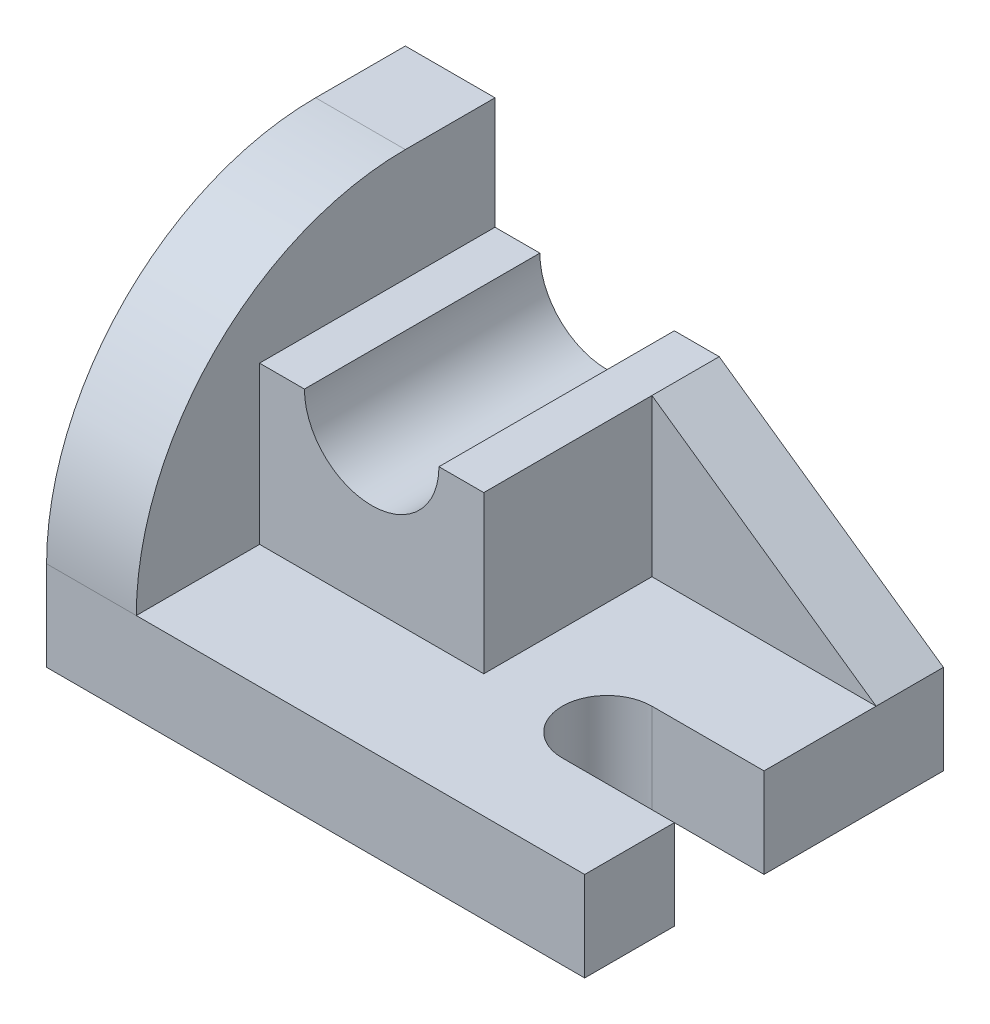
ISO-10303-21;
HEADER;
FILE_DESCRIPTION(('STEP AP214'),'2;1');
FILE_NAME('part.step','',(''),(''),'','','');
FILE_SCHEMA(('AUTOMOTIVE_DESIGN { 1 0 10303 214 1 1 1 1 }'));
ENDSEC;
DATA;
#1=APPLICATION_CONTEXT('core data for automotive mechanical design processes');
#2=APPLICATION_PROTOCOL_DEFINITION('international standard','automotive_design',2000,#1);
#3=PRODUCT_CONTEXT('',#1,'mechanical');
#4=PRODUCT('Part','Part','',(#3));
#5=PRODUCT_RELATED_PRODUCT_CATEGORY('part','',(#4));
#6=PRODUCT_DEFINITION_FORMATION('','',#4);
#7=PRODUCT_DEFINITION_CONTEXT('part definition',#1,'design');
#8=PRODUCT_DEFINITION('design','',#6,#7);
#9=PRODUCT_DEFINITION_SHAPE('','',#8);
#10=(LENGTH_UNIT() NAMED_UNIT(*) SI_UNIT(.MILLI.,.METRE.));
#11=(NAMED_UNIT(*) PLANE_ANGLE_UNIT() SI_UNIT($,.RADIAN.));
#12=(NAMED_UNIT(*) SI_UNIT($,.STERADIAN.) SOLID_ANGLE_UNIT());
#13=UNCERTAINTY_MEASURE_WITH_UNIT(LENGTH_MEASURE(1.E-05),#10,'distance_accuracy_value','');
#14=(GEOMETRIC_REPRESENTATION_CONTEXT(3) GLOBAL_UNCERTAINTY_ASSIGNED_CONTEXT((#13)) GLOBAL_UNIT_ASSIGNED_CONTEXT((#10,
#11,#12)) REPRESENTATION_CONTEXT('',''));
#15=CARTESIAN_POINT('',(0.,0.,0.));
#16=DIRECTION('',(0.,0.,1.));
#17=DIRECTION('',(1.,0.,0.));
#18=AXIS2_PLACEMENT_3D('',#15,#16,#17);
#19=CARTESIAN_POINT('',(76.,16.,-24.));
#20=DIRECTION('',(0.,1.,0.));
#21=DIRECTION('',(0.,0.,1.));
#22=AXIS2_PLACEMENT_3D('',#19,#20,#21);
#23=PLANE('',#22);
#24=DIRECTION('',(0.,0.,-1.));
#25=VECTOR('',#24,1.);
#26=CARTESIAN_POINT('',(96.,16.,-32.));
#27=LINE('',#26,#25);
#28=CARTESIAN_POINT('',(96.,16.,-32.));
#29=VERTEX_POINT('',#28);
#30=CARTESIAN_POINT('',(96.,16.,-52.));
#31=VERTEX_POINT('',#30);
#32=EDGE_CURVE('E132',#29,#31,#27,.T.);
#33=ORIENTED_EDGE('',*,*,#32,.T.);
#34=DIRECTION('',(-1.,0.,0.));
#35=VECTOR('',#34,1.);
#36=CARTESIAN_POINT('',(56.,16.,-52.));
#37=LINE('',#36,#35);
#38=CARTESIAN_POINT('',(56.,16.,-52.));
#39=VERTEX_POINT('',#38);
#40=EDGE_CURVE('E184',#31,#39,#37,.T.);
#41=ORIENTED_EDGE('',*,*,#40,.T.);
#42=DIRECTION('',(0.,0.,-1.));
#43=VECTOR('',#42,1.);
#44=CARTESIAN_POINT('',(56.,16.,-22.));
#45=LINE('',#44,#43);
#46=CARTESIAN_POINT('',(56.,16.,-22.));
#47=VERTEX_POINT('',#46);
#48=EDGE_CURVE('E286',#47,#39,#45,.T.);
#49=ORIENTED_EDGE('',*,*,#48,.F.);
#50=DIRECTION('',(1.,0.,0.));
#51=VECTOR('',#50,1.);
#52=CARTESIAN_POINT('',(0.,16.,-22.));
#53=LINE('',#52,#51);
#54=CARTESIAN_POINT('',(16.,16.,-22.));
#55=VERTEX_POINT('',#54);
#56=EDGE_CURVE('E299',#55,#47,#53,.T.);
#57=ORIENTED_EDGE('',*,*,#56,.F.);
#58=DIRECTION('',(0.,0.,-1.));
#59=VECTOR('',#58,1.);
#60=CARTESIAN_POINT('',(16.,16.,-24.));
#61=LINE('',#60,#59);
#62=CARTESIAN_POINT('',(16.,16.,0.));
#63=VERTEX_POINT('',#62);
#64=EDGE_CURVE('E53',#63,#55,#61,.T.);
#65=ORIENTED_EDGE('',*,*,#64,.F.);
#66=DIRECTION('',(1.,0.,0.));
#67=VECTOR('',#66,1.);
#68=CARTESIAN_POINT('',(0.,16.,0.));
#69=LINE('',#68,#67);
#70=CARTESIAN_POINT('',(96.,16.,0.));
#71=VERTEX_POINT('',#70);
#72=EDGE_CURVE('E100',#63,#71,#69,.T.);
#73=ORIENTED_EDGE('',*,*,#72,.T.);
#74=DIRECTION('',(0.,0.,-1.));
#75=VECTOR('',#74,1.);
#76=CARTESIAN_POINT('',(96.,16.,0.));
#77=LINE('',#76,#75);
#78=CARTESIAN_POINT('',(96.,16.,-16.));
#79=VERTEX_POINT('',#78);
#80=EDGE_CURVE('E114',#71,#79,#77,.T.);
#81=ORIENTED_EDGE('',*,*,#80,.T.);
#82=DIRECTION('',(-1.,0.,0.));
#83=VECTOR('',#82,1.);
#84=CARTESIAN_POINT('',(96.,16.,-16.));
#85=LINE('',#84,#83);
#86=CARTESIAN_POINT('',(76.,16.,-16.));
#87=VERTEX_POINT('',#86);
#88=EDGE_CURVE('E108',#79,#87,#85,.T.);
#89=ORIENTED_EDGE('',*,*,#88,.T.);
#90=CARTESIAN_POINT('',(76.,16.,-24.));
#91=DIRECTION('',(0.,-1.,0.));
#92=DIRECTION('',(0.,0.,1.));
#93=AXIS2_PLACEMENT_3D('',#90,#91,#92);
#94=CIRCLE('',#93,8.);
#95=CARTESIAN_POINT('',(76.,16.,-32.));
#96=VERTEX_POINT('',#95);
#97=EDGE_CURVE('E111',#87,#96,#94,.T.);
#98=ORIENTED_EDGE('',*,*,#97,.T.);
#99=DIRECTION('',(1.,0.,0.));
#100=VECTOR('',#99,1.);
#101=CARTESIAN_POINT('',(96.,16.,-32.));
#102=LINE('',#101,#100);
#103=EDGE_CURVE('E61',#96,#29,#102,.T.);
#104=ORIENTED_EDGE('',*,*,#103,.T.);
#105=EDGE_LOOP('',(#33,#41,#49,#57,#65,#73,#81,#89,#98,#104));
#106=FACE_BOUND('',#105,.T.);
#107=ADVANCED_FACE('F38',(#106),#23,.T.);
#108=CARTESIAN_POINT('',(56.,0.,-22.));
#109=DIRECTION('',(-1.,0.,0.));
#110=DIRECTION('',(0.,0.,1.));
#111=AXIS2_PLACEMENT_3D('',#108,#109,#110);
#112=PLANE('',#111);
#113=DIRECTION('',(0.,1.,0.));
#114=VECTOR('',#113,1.);
#115=CARTESIAN_POINT('',(56.,44.,-52.));
#116=LINE('',#115,#114);
#117=CARTESIAN_POINT('',(56.,44.,-52.));
#118=VERTEX_POINT('',#117);
#119=EDGE_CURVE('E317',#39,#118,#116,.T.);
#120=ORIENTED_EDGE('',*,*,#119,.T.);
#121=DIRECTION('',(0.,0.,-1.));
#122=VECTOR('',#121,1.);
#123=CARTESIAN_POINT('',(56.,44.,-22.));
#124=LINE('',#123,#122);
#125=CARTESIAN_POINT('',(56.,44.,-22.));
#126=VERTEX_POINT('',#125);
#127=EDGE_CURVE('E282',#126,#118,#124,.T.);
#128=ORIENTED_EDGE('',*,*,#127,.F.);
#129=DIRECTION('',(0.,1.,0.));
#130=VECTOR('',#129,1.);
#131=CARTESIAN_POINT('',(56.,0.,-22.));
#132=LINE('',#131,#130);
#133=EDGE_CURVE('E301',#47,#126,#132,.T.);
#134=ORIENTED_EDGE('',*,*,#133,.F.);
#135=ORIENTED_EDGE('',*,*,#48,.T.);
#136=EDGE_LOOP('',(#120,#128,#134,#135));
#137=FACE_BOUND('',#136,.T.);
#138=ADVANCED_FACE('F322',(#137),#112,.F.);
#139=CARTESIAN_POINT('',(0.,16.,0.));
#140=DIRECTION('',(1.,0.,0.));
#141=DIRECTION('',(0.,0.,-1.));
#142=AXIS2_PLACEMENT_3D('',#139,#140,#141);
#143=PLANE('',#142);
#144=DIRECTION('',(0.,0.,1.));
#145=VECTOR('',#144,1.);
#146=CARTESIAN_POINT('',(0.,0.,0.));
#147=LINE('',#146,#145);
#148=CARTESIAN_POINT('',(0.,0.,-64.));
#149=VERTEX_POINT('',#148);
#150=CARTESIAN_POINT('',(0.,0.,0.));
#151=VERTEX_POINT('',#150);
#152=EDGE_CURVE('E138',#149,#151,#147,.T.);
#153=ORIENTED_EDGE('',*,*,#152,.T.);
#154=DIRECTION('',(0.,-1.,0.));
#155=VECTOR('',#154,1.);
#156=CARTESIAN_POINT('',(0.,16.,0.));
#157=LINE('',#156,#155);
#158=CARTESIAN_POINT('',(0.,16.,0.));
#159=VERTEX_POINT('',#158);
#160=EDGE_CURVE('E11',#159,#151,#157,.T.);
#161=ORIENTED_EDGE('',*,*,#160,.F.);
#162=CARTESIAN_POINT('',(0.,16.,-48.));
#163=DIRECTION('',(-1.,0.,0.));
#164=DIRECTION('',(0.,0.,-1.));
#165=AXIS2_PLACEMENT_3D('',#162,#163,#164);
#166=CIRCLE('',#165,48.);
#167=CARTESIAN_POINT('',(0.,64.,-48.));
#168=VERTEX_POINT('',#167);
#169=EDGE_CURVE('E258',#159,#168,#166,.T.);
#170=ORIENTED_EDGE('',*,*,#169,.T.);
#171=DIRECTION('',(0.,0.,-1.));
#172=VECTOR('',#171,1.);
#173=CARTESIAN_POINT('',(0.,64.,-64.));
#174=LINE('',#173,#172);
#175=CARTESIAN_POINT('',(0.,64.,-64.));
#176=VERTEX_POINT('',#175);
#177=EDGE_CURVE('E252',#168,#176,#174,.T.);
#178=ORIENTED_EDGE('',*,*,#177,.T.);
#179=DIRECTION('',(0.,-1.,0.));
#180=VECTOR('',#179,1.);
#181=CARTESIAN_POINT('',(0.,16.,-64.));
#182=LINE('',#181,#180);
#183=EDGE_CURVE('E137',#176,#149,#182,.T.);
#184=ORIENTED_EDGE('',*,*,#183,.T.);
#185=EDGE_LOOP('',(#153,#161,#170,#178,#184));
#186=FACE_BOUND('',#185,.T.);
#187=ADVANCED_FACE('F40',(#186),#143,.F.);
#188=CARTESIAN_POINT('',(0.,16.,0.));
#189=DIRECTION('',(0.,0.,-1.));
#190=DIRECTION('',(-1.,0.,0.));
#191=AXIS2_PLACEMENT_3D('',#188,#189,#190);
#192=PLANE('',#191);
#193=ORIENTED_EDGE('',*,*,#72,.F.);
#194=EDGE_CURVE('E269',#159,#63,#69,.T.);
#195=ORIENTED_EDGE('',*,*,#194,.F.);
#196=ORIENTED_EDGE('',*,*,#160,.T.);
#197=DIRECTION('',(1.,0.,0.));
#198=VECTOR('',#197,1.);
#199=CARTESIAN_POINT('',(0.,0.,0.));
#200=LINE('',#199,#198);
#201=CARTESIAN_POINT('',(96.,0.,0.));
#202=VERTEX_POINT('',#201);
#203=EDGE_CURVE('E141',#151,#202,#200,.T.);
#204=ORIENTED_EDGE('',*,*,#203,.T.);
#205=DIRECTION('',(0.,-1.,0.));
#206=VECTOR('',#205,1.);
#207=CARTESIAN_POINT('',(96.,16.,0.));
#208=LINE('',#207,#206);
#209=EDGE_CURVE('E46',#71,#202,#208,.T.);
#210=ORIENTED_EDGE('',*,*,#209,.F.);
#211=EDGE_LOOP('',(#193,#195,#196,#204,#210));
#212=FACE_BOUND('',#211,.T.);
#213=ADVANCED_FACE('F370',(#212),#192,.F.);
#214=CARTESIAN_POINT('',(96.,16.,0.));
#215=DIRECTION('',(-1.,0.,0.));
#216=DIRECTION('',(0.,0.,1.));
#217=AXIS2_PLACEMENT_3D('',#214,#215,#216);
#218=PLANE('',#217);
#219=DIRECTION('',(0.,0.,-1.));
#220=VECTOR('',#219,1.);
#221=CARTESIAN_POINT('',(96.,0.,0.));
#222=LINE('',#221,#220);
#223=CARTESIAN_POINT('',(96.,0.,-16.));
#224=VERTEX_POINT('',#223);
#225=EDGE_CURVE('E143',#202,#224,#222,.T.);
#226=ORIENTED_EDGE('',*,*,#225,.T.);
#227=DIRECTION('',(0.,-1.,0.));
#228=VECTOR('',#227,1.);
#229=CARTESIAN_POINT('',(96.,16.,-16.));
#230=LINE('',#229,#228);
#231=EDGE_CURVE('E126',#79,#224,#230,.T.);
#232=ORIENTED_EDGE('',*,*,#231,.F.);
#233=ORIENTED_EDGE('',*,*,#80,.F.);
#234=ORIENTED_EDGE('',*,*,#209,.T.);
#235=EDGE_LOOP('',(#226,#232,#233,#234));
#236=FACE_BOUND('',#235,.T.);
#237=ADVANCED_FACE('F163',(#236),#218,.F.);
#238=CARTESIAN_POINT('',(96.,16.,-16.));
#239=DIRECTION('',(0.,0.,1.));
#240=DIRECTION('',(1.,0.,0.));
#241=AXIS2_PLACEMENT_3D('',#238,#239,#240);
#242=PLANE('',#241);
#243=DIRECTION('',(-1.,0.,0.));
#244=VECTOR('',#243,1.);
#245=CARTESIAN_POINT('',(96.,0.,-16.));
#246=LINE('',#245,#244);
#247=CARTESIAN_POINT('',(76.,0.,-16.));
#248=VERTEX_POINT('',#247);
#249=EDGE_CURVE('E123',#224,#248,#246,.T.);
#250=ORIENTED_EDGE('',*,*,#249,.T.);
#251=DIRECTION('',(0.,-1.,0.));
#252=VECTOR('',#251,1.);
#253=CARTESIAN_POINT('',(76.,16.,-16.));
#254=LINE('',#253,#252);
#255=EDGE_CURVE('E120',#87,#248,#254,.T.);
#256=ORIENTED_EDGE('',*,*,#255,.F.);
#257=ORIENTED_EDGE('',*,*,#88,.F.);
#258=ORIENTED_EDGE('',*,*,#231,.T.);
#259=EDGE_LOOP('',(#250,#256,#257,#258));
#260=FACE_BOUND('',#259,.T.);
#261=ADVANCED_FACE('F121',(#260),#242,.F.);
#262=CARTESIAN_POINT('',(76.,16.,-24.));
#263=DIRECTION('',(0.,-1.,0.));
#264=DIRECTION('',(0.,0.,-1.));
#265=AXIS2_PLACEMENT_3D('',#262,#263,#264);
#266=CYLINDRICAL_SURFACE('',#265,8.);
#267=CARTESIAN_POINT('',(76.,0.,-24.));
#268=DIRECTION('',(0.,-1.,0.));
#269=DIRECTION('',(0.,0.,1.));
#270=AXIS2_PLACEMENT_3D('',#267,#268,#269);
#271=CIRCLE('',#270,8.);
#272=CARTESIAN_POINT('',(76.,0.,-32.));
#273=VERTEX_POINT('',#272);
#274=EDGE_CURVE('E146',#248,#273,#271,.T.);
#275=ORIENTED_EDGE('',*,*,#274,.T.);
#276=DIRECTION('',(0.,-1.,0.));
#277=VECTOR('',#276,1.);
#278=CARTESIAN_POINT('',(76.,16.,-32.));
#279=LINE('',#278,#277);
#280=EDGE_CURVE('E127',#96,#273,#279,.T.);
#281=ORIENTED_EDGE('',*,*,#280,.F.);
#282=ORIENTED_EDGE('',*,*,#97,.F.);
#283=ORIENTED_EDGE('',*,*,#255,.T.);
#284=EDGE_LOOP('',(#275,#281,#282,#283));
#285=FACE_BOUND('',#284,.T.);
#286=ADVANCED_FACE('F129',(#285),#266,.F.);
#287=CARTESIAN_POINT('',(96.,16.,-32.));
#288=DIRECTION('',(0.,0.,-1.));
#289=DIRECTION('',(-1.,0.,0.));
#290=AXIS2_PLACEMENT_3D('',#287,#288,#289);
#291=PLANE('',#290);
#292=DIRECTION('',(1.,0.,0.));
#293=VECTOR('',#292,1.);
#294=CARTESIAN_POINT('',(96.,0.,-32.));
#295=LINE('',#294,#293);
#296=CARTESIAN_POINT('',(96.,0.,-32.));
#297=VERTEX_POINT('',#296);
#298=EDGE_CURVE('E148',#273,#297,#295,.T.);
#299=ORIENTED_EDGE('',*,*,#298,.T.);
#300=DIRECTION('',(0.,-1.,0.));
#301=VECTOR('',#300,1.);
#302=CARTESIAN_POINT('',(96.,16.,-32.));
#303=LINE('',#302,#301);
#304=EDGE_CURVE('E156',#29,#297,#303,.T.);
#305=ORIENTED_EDGE('',*,*,#304,.F.);
#306=ORIENTED_EDGE('',*,*,#103,.F.);
#307=ORIENTED_EDGE('',*,*,#280,.T.);
#308=EDGE_LOOP('',(#299,#305,#306,#307));
#309=FACE_BOUND('',#308,.T.);
#310=ADVANCED_FACE('F171',(#309),#291,.F.);
#311=CARTESIAN_POINT('',(96.,16.,-32.));
#312=DIRECTION('',(-1.,0.,0.));
#313=DIRECTION('',(0.,0.,1.));
#314=AXIS2_PLACEMENT_3D('',#311,#312,#313);
#315=PLANE('',#314);
#316=DIRECTION('',(0.,0.,-1.));
#317=VECTOR('',#316,1.);
#318=CARTESIAN_POINT('',(96.,0.,-32.));
#319=LINE('',#318,#317);
#320=CARTESIAN_POINT('',(96.,0.,-64.));
#321=VERTEX_POINT('',#320);
#322=EDGE_CURVE('E150',#297,#321,#319,.T.);
#323=ORIENTED_EDGE('',*,*,#322,.T.);
#324=DIRECTION('',(0.,-1.,0.));
#325=VECTOR('',#324,1.);
#326=CARTESIAN_POINT('',(96.,16.,-64.));
#327=LINE('',#326,#325);
#328=CARTESIAN_POINT('',(96.,16.,-64.));
#329=VERTEX_POINT('',#328);
#330=EDGE_CURVE('E154',#329,#321,#327,.T.);
#331=ORIENTED_EDGE('',*,*,#330,.F.);
#332=DIRECTION('',(0.,0.,-1.));
#333=VECTOR('',#332,1.);
#334=CARTESIAN_POINT('',(96.,16.,-52.));
#335=LINE('',#334,#333);
#336=EDGE_CURVE('E179',#31,#329,#335,.T.);
#337=ORIENTED_EDGE('',*,*,#336,.F.);
#338=ORIENTED_EDGE('',*,*,#32,.F.);
#339=ORIENTED_EDGE('',*,*,#304,.T.);
#340=EDGE_LOOP('',(#323,#331,#337,#338,#339));
#341=FACE_BOUND('',#340,.T.);
#342=ADVANCED_FACE('F175',(#341),#315,.F.);
#343=CARTESIAN_POINT('',(0.,16.,-64.));
#344=DIRECTION('',(0.,0.,1.));
#345=DIRECTION('',(1.,0.,0.));
#346=AXIS2_PLACEMENT_3D('',#343,#344,#345);
#347=PLANE('',#346);
#348=DIRECTION('',(1.,0.,0.));
#349=VECTOR('',#348,1.);
#350=CARTESIAN_POINT('',(0.,44.,-64.));
#351=LINE('',#350,#349);
#352=CARTESIAN_POINT('',(48.,44.,-64.));
#353=VERTEX_POINT('',#352);
#354=CARTESIAN_POINT('',(56.,44.,-64.));
#355=VERTEX_POINT('',#354);
#356=EDGE_CURVE('E291',#353,#355,#351,.T.);
#357=ORIENTED_EDGE('',*,*,#356,.T.);
#358=DIRECTION('',(0.819231920519041,-0.573462344363328,0.));
#359=VECTOR('',#358,1.);
#360=CARTESIAN_POINT('',(96.,16.,-64.));
#361=LINE('',#360,#359);
#362=EDGE_CURVE('E313',#355,#329,#361,.T.);
#363=ORIENTED_EDGE('',*,*,#362,.T.);
#364=ORIENTED_EDGE('',*,*,#330,.T.);
#365=DIRECTION('',(-1.,0.,0.));
#366=VECTOR('',#365,1.);
#367=CARTESIAN_POINT('',(0.,0.,-64.));
#368=LINE('',#367,#366);
#369=EDGE_CURVE('E95',#321,#149,#368,.T.);
#370=ORIENTED_EDGE('',*,*,#369,.T.);
#371=ORIENTED_EDGE('',*,*,#183,.F.);
#372=DIRECTION('',(-1.,0.,0.));
#373=VECTOR('',#372,1.);
#374=CARTESIAN_POINT('',(16.,64.,-64.));
#375=LINE('',#374,#373);
#376=CARTESIAN_POINT('',(16.,64.,-64.));
#377=VERTEX_POINT('',#376);
#378=EDGE_CURVE('E246',#377,#176,#375,.T.);
#379=ORIENTED_EDGE('',*,*,#378,.F.);
#380=DIRECTION('',(0.,-1.,0.));
#381=VECTOR('',#380,1.);
#382=CARTESIAN_POINT('',(16.,0.,-64.));
#383=LINE('',#382,#381);
#384=CARTESIAN_POINT('',(16.,44.,-64.));
#385=VERTEX_POINT('',#384);
#386=EDGE_CURVE('E267',#377,#385,#383,.T.);
#387=ORIENTED_EDGE('',*,*,#386,.T.);
#388=CARTESIAN_POINT('',(24.,44.,-64.));
#389=VERTEX_POINT('',#388);
#390=EDGE_CURVE('E293',#385,#389,#351,.T.);
#391=ORIENTED_EDGE('',*,*,#390,.T.);
#392=CARTESIAN_POINT('',(36.,44.,-64.));
#393=DIRECTION('',(0.,0.,-1.));
#394=DIRECTION('',(-1.,0.,0.));
#395=AXIS2_PLACEMENT_3D('',#392,#393,#394);
#396=CIRCLE('',#395,12.);
#397=EDGE_CURVE('E294',#353,#389,#396,.T.);
#398=ORIENTED_EDGE('',*,*,#397,.F.);
#399=EDGE_LOOP('',(#357,#363,#364,#370,#371,#379,#387,#391,#398));
#400=FACE_BOUND('',#399,.T.);
#401=ADVANCED_FACE('F244',(#400),#347,.F.);
#402=CARTESIAN_POINT('',(76.,0.,-24.));
#403=DIRECTION('',(0.,1.,0.));
#404=DIRECTION('',(0.,0.,1.));
#405=AXIS2_PLACEMENT_3D('',#402,#403,#404);
#406=PLANE('',#405);
#407=ORIENTED_EDGE('',*,*,#225,.F.);
#408=ORIENTED_EDGE('',*,*,#203,.F.);
#409=ORIENTED_EDGE('',*,*,#152,.F.);
#410=ORIENTED_EDGE('',*,*,#369,.F.);
#411=ORIENTED_EDGE('',*,*,#322,.F.);
#412=ORIENTED_EDGE('',*,*,#298,.F.);
#413=ORIENTED_EDGE('',*,*,#274,.F.);
#414=ORIENTED_EDGE('',*,*,#249,.F.);
#415=EDGE_LOOP('',(#407,#408,#409,#410,#411,#412,#413,#414));
#416=FACE_BOUND('',#415,.T.);
#417=ADVANCED_FACE('F166',(#416),#406,.F.);
#418=CARTESIAN_POINT('',(16.,64.,-64.));
#419=DIRECTION('',(0.,1.,0.));
#420=DIRECTION('',(0.,0.,1.));
#421=AXIS2_PLACEMENT_3D('',#418,#419,#420);
#422=PLANE('',#421);
#423=ORIENTED_EDGE('',*,*,#177,.F.);
#424=DIRECTION('',(-1.,0.,0.));
#425=VECTOR('',#424,1.);
#426=CARTESIAN_POINT('',(16.,64.,-48.));
#427=LINE('',#426,#425);
#428=CARTESIAN_POINT('',(16.,64.,-48.));
#429=VERTEX_POINT('',#428);
#430=EDGE_CURVE('E240',#429,#168,#427,.T.);
#431=ORIENTED_EDGE('',*,*,#430,.F.);
#432=DIRECTION('',(0.,0.,-1.));
#433=VECTOR('',#432,1.);
#434=CARTESIAN_POINT('',(16.,64.,-64.));
#435=LINE('',#434,#433);
#436=EDGE_CURVE('E255',#429,#377,#435,.T.);
#437=ORIENTED_EDGE('',*,*,#436,.T.);
#438=ORIENTED_EDGE('',*,*,#378,.T.);
#439=EDGE_LOOP('',(#423,#431,#437,#438));
#440=FACE_BOUND('',#439,.T.);
#441=ADVANCED_FACE('F251',(#440),#422,.T.);
#442=CARTESIAN_POINT('',(16.,16.,-48.));
#443=DIRECTION('',(-1.,0.,0.));
#444=DIRECTION('',(0.,0.,1.));
#445=AXIS2_PLACEMENT_3D('',#442,#443,#444);
#446=CYLINDRICAL_SURFACE('',#445,48.);
#447=ORIENTED_EDGE('',*,*,#169,.F.);
#448=ORIENTED_EDGE('',*,*,#194,.T.);
#449=CARTESIAN_POINT('',(16.,16.,-48.));
#450=DIRECTION('',(-1.,0.,0.));
#451=DIRECTION('',(0.,0.,-1.));
#452=AXIS2_PLACEMENT_3D('',#449,#450,#451);
#453=CIRCLE('',#452,48.);
#454=EDGE_CURVE('E259',#63,#429,#453,.T.);
#455=ORIENTED_EDGE('',*,*,#454,.T.);
#456=ORIENTED_EDGE('',*,*,#430,.T.);
#457=EDGE_LOOP('',(#447,#448,#455,#456));
#458=FACE_BOUND('',#457,.T.);
#459=ADVANCED_FACE('F273',(#458),#446,.T.);
#460=CARTESIAN_POINT('',(16.,16.,-48.));
#461=DIRECTION('',(1.,0.,0.));
#462=DIRECTION('',(0.,0.,-1.));
#463=AXIS2_PLACEMENT_3D('',#460,#461,#462);
#464=PLANE('',#463);
#465=DIRECTION('',(0.,0.,-1.));
#466=VECTOR('',#465,1.);
#467=CARTESIAN_POINT('',(16.,44.,-22.));
#468=LINE('',#467,#466);
#469=CARTESIAN_POINT('',(16.,44.,-22.));
#470=VERTEX_POINT('',#469);
#471=EDGE_CURVE('E288',#470,#385,#468,.T.);
#472=ORIENTED_EDGE('',*,*,#471,.T.);
#473=ORIENTED_EDGE('',*,*,#386,.F.);
#474=ORIENTED_EDGE('',*,*,#436,.F.);
#475=ORIENTED_EDGE('',*,*,#454,.F.);
#476=ORIENTED_EDGE('',*,*,#64,.T.);
#477=DIRECTION('',(0.,-1.,0.));
#478=VECTOR('',#477,1.);
#479=CARTESIAN_POINT('',(16.,0.,-22.));
#480=LINE('',#479,#478);
#481=EDGE_CURVE('E297',#470,#55,#480,.T.);
#482=ORIENTED_EDGE('',*,*,#481,.F.);
#483=EDGE_LOOP('',(#472,#473,#474,#475,#476,#482));
#484=FACE_BOUND('',#483,.T.);
#485=ADVANCED_FACE('F276',(#484),#464,.T.);
#486=CARTESIAN_POINT('',(36.,44.,-22.));
#487=DIRECTION('',(0.,0.,-1.));
#488=DIRECTION('',(-1.,0.,0.));
#489=AXIS2_PLACEMENT_3D('',#486,#487,#488);
#490=CYLINDRICAL_SURFACE('',#489,12.);
#491=ORIENTED_EDGE('',*,*,#397,.T.);
#492=DIRECTION('',(0.,0.,-1.));
#493=VECTOR('',#492,1.);
#494=CARTESIAN_POINT('',(24.,44.,-22.));
#495=LINE('',#494,#493);
#496=CARTESIAN_POINT('',(24.,44.,-22.));
#497=VERTEX_POINT('',#496);
#498=EDGE_CURVE('E262',#497,#389,#495,.T.);
#499=ORIENTED_EDGE('',*,*,#498,.F.);
#500=CARTESIAN_POINT('',(36.,44.,-22.));
#501=DIRECTION('',(0.,0.,-1.));
#502=DIRECTION('',(-1.,0.,0.));
#503=AXIS2_PLACEMENT_3D('',#500,#501,#502);
#504=CIRCLE('',#503,12.);
#505=CARTESIAN_POINT('',(48.,44.,-22.));
#506=VERTEX_POINT('',#505);
#507=EDGE_CURVE('E306',#506,#497,#504,.T.);
#508=ORIENTED_EDGE('',*,*,#507,.F.);
#509=DIRECTION('',(0.,0.,-1.));
#510=VECTOR('',#509,1.);
#511=CARTESIAN_POINT('',(48.,44.,-22.));
#512=LINE('',#511,#510);
#513=EDGE_CURVE('E280',#506,#353,#512,.T.);
#514=ORIENTED_EDGE('',*,*,#513,.T.);
#515=EDGE_LOOP('',(#491,#499,#508,#514));
#516=FACE_BOUND('',#515,.T.);
#517=ADVANCED_FACE('F339',(#516),#490,.F.);
#518=CARTESIAN_POINT('',(0.,44.,-22.));
#519=DIRECTION('',(0.,1.,0.));
#520=DIRECTION('',(-1.,0.,0.));
#521=AXIS2_PLACEMENT_3D('',#518,#519,#520);
#522=PLANE('',#521);
#523=ORIENTED_EDGE('',*,*,#390,.F.);
#524=ORIENTED_EDGE('',*,*,#471,.F.);
#525=DIRECTION('',(1.,0.,0.));
#526=VECTOR('',#525,1.);
#527=CARTESIAN_POINT('',(0.,44.,-22.));
#528=LINE('',#527,#526);
#529=EDGE_CURVE('E283',#470,#497,#528,.T.);
#530=ORIENTED_EDGE('',*,*,#529,.T.);
#531=ORIENTED_EDGE('',*,*,#498,.T.);
#532=EDGE_LOOP('',(#523,#524,#530,#531));
#533=FACE_BOUND('',#532,.T.);
#534=ADVANCED_FACE('F337',(#533),#522,.T.);
#535=ORIENTED_EDGE('',*,*,#356,.F.);
#536=ORIENTED_EDGE('',*,*,#513,.F.);
#537=EDGE_CURVE('E303',#506,#126,#528,.T.);
#538=ORIENTED_EDGE('',*,*,#537,.T.);
#539=ORIENTED_EDGE('',*,*,#127,.T.);
#540=DIRECTION('',(0.,0.,-1.));
#541=VECTOR('',#540,1.);
#542=CARTESIAN_POINT('',(56.,44.,-52.));
#543=LINE('',#542,#541);
#544=EDGE_CURVE('E308',#118,#355,#543,.T.);
#545=ORIENTED_EDGE('',*,*,#544,.T.);
#546=EDGE_LOOP('',(#535,#536,#538,#539,#545));
#547=FACE_BOUND('',#546,.T.);
#548=ADVANCED_FACE('F326',(#547),#522,.T.);
#549=CARTESIAN_POINT('',(0.,0.,-22.));
#550=DIRECTION('',(0.,0.,-1.));
#551=DIRECTION('',(-1.,0.,0.));
#552=AXIS2_PLACEMENT_3D('',#549,#550,#551);
#553=PLANE('',#552);
#554=ORIENTED_EDGE('',*,*,#507,.T.);
#555=ORIENTED_EDGE('',*,*,#529,.F.);
#556=ORIENTED_EDGE('',*,*,#481,.T.);
#557=ORIENTED_EDGE('',*,*,#56,.T.);
#558=ORIENTED_EDGE('',*,*,#133,.T.);
#559=ORIENTED_EDGE('',*,*,#537,.F.);
#560=EDGE_LOOP('',(#554,#555,#556,#557,#558,#559));
#561=FACE_BOUND('',#560,.T.);
#562=ADVANCED_FACE('F330',(#561),#553,.F.);
#563=CARTESIAN_POINT('',(96.,16.,-52.));
#564=DIRECTION('',(0.573462344363328,0.819231920519041,0.));
#565=DIRECTION('',(-0.819231920519041,0.573462344363328,0.));
#566=AXIS2_PLACEMENT_3D('',#563,#564,#565);
#567=PLANE('',#566);
#568=ORIENTED_EDGE('',*,*,#362,.F.);
#569=ORIENTED_EDGE('',*,*,#544,.F.);
#570=DIRECTION('',(0.819231920519041,-0.573462344363328,0.));
#571=VECTOR('',#570,1.);
#572=CARTESIAN_POINT('',(96.,16.,-52.));
#573=LINE('',#572,#571);
#574=EDGE_CURVE('E311',#118,#31,#573,.T.);
#575=ORIENTED_EDGE('',*,*,#574,.T.);
#576=ORIENTED_EDGE('',*,*,#336,.T.);
#577=EDGE_LOOP('',(#568,#569,#575,#576));
#578=FACE_BOUND('',#577,.T.);
#579=ADVANCED_FACE('F416',(#578),#567,.T.);
#580=CARTESIAN_POINT('',(0.,0.,-52.));
#581=DIRECTION('',(0.,0.,-1.));
#582=DIRECTION('',(-1.,0.,0.));
#583=AXIS2_PLACEMENT_3D('',#580,#581,#582);
#584=PLANE('',#583);
#585=ORIENTED_EDGE('',*,*,#40,.F.);
#586=ORIENTED_EDGE('',*,*,#574,.F.);
#587=ORIENTED_EDGE('',*,*,#119,.F.);
#588=EDGE_LOOP('',(#585,#586,#587));
#589=FACE_BOUND('',#588,.T.);
#590=ADVANCED_FACE('F420',(#589),#584,.F.);
#591=CLOSED_SHELL('',(#107,#138,#187,#213,#237,#261,#286,#310,#342,#401,#417,#441,#459,#485,
#517,#534,#548,#562,#579,#590));
#592=MANIFOLD_SOLID_BREP('B2',#591);
#593=ADVANCED_BREP_SHAPE_REPRESENTATION('',(#18,#592),#14);
#594=SHAPE_DEFINITION_REPRESENTATION(#9,#593);
ENDSEC;
END-ISO-10303-21;
